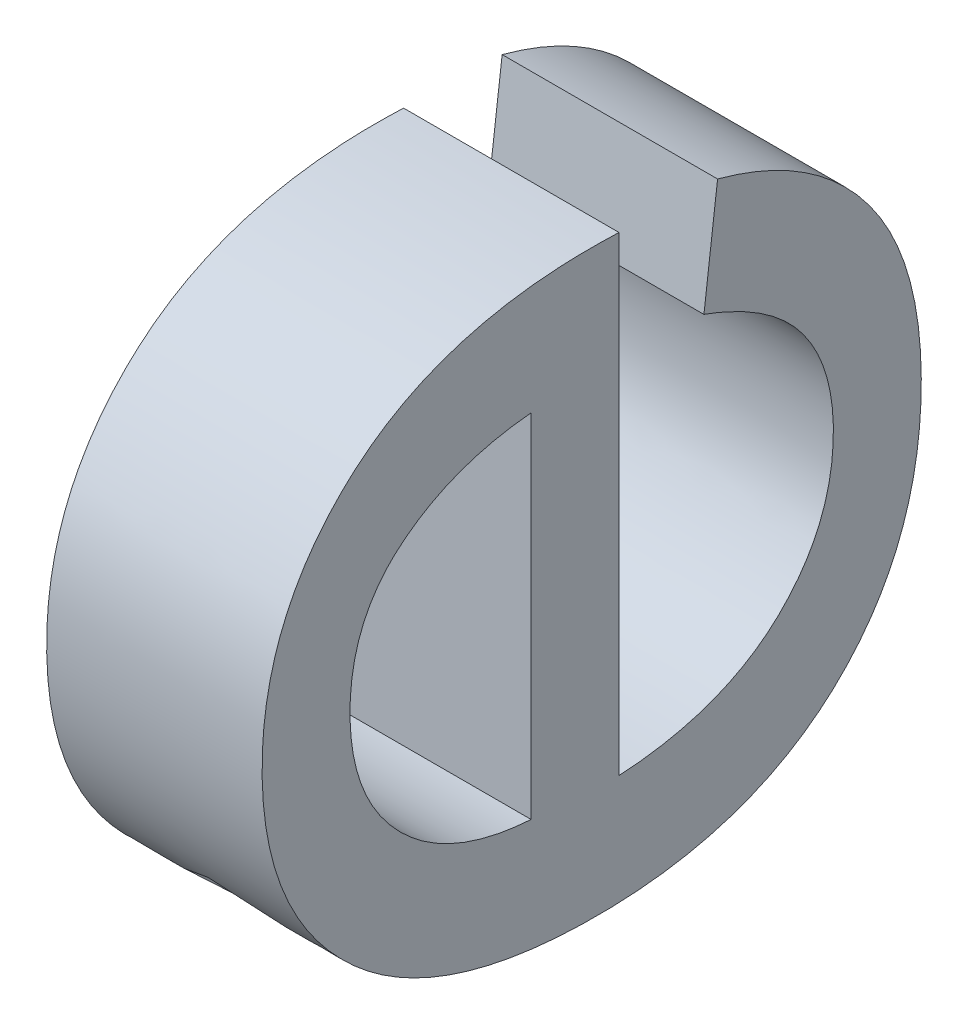
ISO-10303-21;
HEADER;
FILE_DESCRIPTION(('STEP AP214'),'2;1');
FILE_NAME('part.step','',(''),(''),'','','');
FILE_SCHEMA(('AUTOMOTIVE_DESIGN { 1 0 10303 214 1 1 1 1 }'));
ENDSEC;
DATA;
#1=APPLICATION_CONTEXT('core data for automotive mechanical design processes');
#2=APPLICATION_PROTOCOL_DEFINITION('international standard','automotive_design',2000,#1);
#3=PRODUCT_CONTEXT('',#1,'mechanical');
#4=PRODUCT('Part','Part','',(#3));
#5=PRODUCT_RELATED_PRODUCT_CATEGORY('part','',(#4));
#6=PRODUCT_DEFINITION_FORMATION('','',#4);
#7=PRODUCT_DEFINITION_CONTEXT('part definition',#1,'design');
#8=PRODUCT_DEFINITION('design','',#6,#7);
#9=PRODUCT_DEFINITION_SHAPE('','',#8);
#10=(LENGTH_UNIT() NAMED_UNIT(*) SI_UNIT(.MILLI.,.METRE.));
#11=(NAMED_UNIT(*) PLANE_ANGLE_UNIT() SI_UNIT($,.RADIAN.));
#12=(NAMED_UNIT(*) SI_UNIT($,.STERADIAN.) SOLID_ANGLE_UNIT());
#13=UNCERTAINTY_MEASURE_WITH_UNIT(LENGTH_MEASURE(1.E-05),#10,'distance_accuracy_value','');
#14=(GEOMETRIC_REPRESENTATION_CONTEXT(3) GLOBAL_UNCERTAINTY_ASSIGNED_CONTEXT((#13)) GLOBAL_UNIT_ASSIGNED_CONTEXT((#10,
#11,#12)) REPRESENTATION_CONTEXT('',''));
#15=CARTESIAN_POINT('',(0.,0.,0.));
#16=DIRECTION('',(0.,0.,1.));
#17=DIRECTION('',(1.,0.,0.));
#18=AXIS2_PLACEMENT_3D('',#15,#16,#17);
#19=CARTESIAN_POINT('',(4.55229940712892,-37.8479146998707,-8.87455840971013));
#20=DIRECTION('',(-1.,0.,0.));
#21=DIRECTION('',(0.,0.,1.));
#22=AXIS2_PLACEMENT_3D('',#19,#20,#21);
#23=PLANE('',#22);
#24=CARTESIAN_POINT('',(4.55229940712891,-37.7601534986081,-9.03767640216285));
#25=CARTESIAN_POINT('',(4.5522994071289,-37.6784222189086,-9.03767640216285));
#26=CARTESIAN_POINT('',(4.55229940712889,-37.596690939209,-9.03767640216285));
#27=(BOUNDED_CURVE() B_SPLINE_CURVE(2,(#24,#25,#26),.UNSPECIFIED.,.F.,
.F.) B_SPLINE_CURVE_WITH_KNOTS((3,3),(35.,36.),
.UNSPECIFIED.) CURVE() GEOMETRIC_REPRESENTATION_ITEM() RATIONAL_B_SPLINE_CURVE((1.,1.,1.)) REPRESENTATION_ITEM(''));
#28=CARTESIAN_POINT('',(4.55229940712891,-37.7601534986081,-9.03767640216285));
#29=VERTEX_POINT('',#28);
#30=CARTESIAN_POINT('',(4.55229940712889,-37.596690939209,-9.03767640216285));
#31=VERTEX_POINT('',#30);
#32=EDGE_CURVE('E134',#29,#31,#27,.T.);
#33=ORIENTED_EDGE('',*,*,#32,.T.);
#34=CARTESIAN_POINT('',(4.55229940712889,-37.596690939209,-9.03767640216285));
#35=CARTESIAN_POINT('',(4.55229940712889,-37.599998781895,-9.00073882550267));
#36=CARTESIAN_POINT('',(4.55229940712889,-37.6391415870125,-8.95360206722736));
#37=CARTESIAN_POINT('',(4.5522994071289,-37.7110871654327,-8.95360206722736));
#38=CARTESIAN_POINT('',(4.55229940712891,-37.7576726165936,-8.99936055771684));
#39=CARTESIAN_POINT('',(4.55229940712891,-37.7601534986081,-9.03767640216285));
#40=(BOUNDED_CURVE() B_SPLINE_CURVE(2,(#34,#35,#36,#37,#38,#39),.UNSPECIFIED.,.F.,
.F.) B_SPLINE_CURVE_WITH_KNOTS((3,1,1,1,3),(36.,37.,38.,39.,40.),
.UNSPECIFIED.) CURVE() GEOMETRIC_REPRESENTATION_ITEM() RATIONAL_B_SPLINE_CURVE((1.,1.,1.,1.,1.,1.)) REPRESENTATION_ITEM(''));
#41=EDGE_CURVE('E11',#31,#29,#40,.T.);
#42=ORIENTED_EDGE('',*,*,#41,.T.);
#43=EDGE_LOOP('',(#33,#42));
#44=FACE_BOUND('',#43,.T.);
#45=CARTESIAN_POINT('',(4.55229940712888,-37.5459706846905,-9.12423161911283));
#46=CARTESIAN_POINT('',(4.55229940712888,-37.5580994412058,-9.16916314893081));
#47=CARTESIAN_POINT('',(4.55229940712889,-37.5909022145085,-9.19397196907571));
#48=CARTESIAN_POINT('',(4.55229940712889,-37.6237049878112,-9.21878078922061));
#49=CARTESIAN_POINT('',(4.5522994071289,-37.6747008958868,-9.21878078922061));
#50=CARTESIAN_POINT('',(4.55229940712891,-37.7389281747064,-9.21878078922061));
#51=CARTESIAN_POINT('',(4.55229940712891,-37.7765548852595,-9.17922450376736));
#52=CARTESIAN_POINT('',(4.55229940712892,-37.8141815958126,-9.1396682183141));
#53=CARTESIAN_POINT('',(4.55229940712892,-37.8141815958126,-9.06827394700823));
#54=CARTESIAN_POINT('',(4.55229940712892,-37.8141815958126,-8.99439879368786));
#55=CARTESIAN_POINT('',(4.55229940712891,-37.7761414049237,-8.95360206722736));
#56=CARTESIAN_POINT('',(4.5522994071289,-37.7381012140349,-8.91280534076686));
#57=CARTESIAN_POINT('',(4.5522994071289,-37.6774574314585,-8.91280534076686));
#58=CARTESIAN_POINT('',(4.55229940712889,-37.6187432237822,-8.91280534076686));
#59=CARTESIAN_POINT('',(4.55229940712888,-37.5815299935648,-8.95277510655587));
#60=CARTESIAN_POINT('',(4.55229940712888,-37.5443167633475,-8.99274487234486));
#61=CARTESIAN_POINT('',(4.55229940712888,-37.5443167633475,-9.0652417578794));
#62=CARTESIAN_POINT('',(4.55229940712888,-37.5443167633475,-9.06965221479405));
#63=CARTESIAN_POINT('',(4.55229940712888,-37.5445924169047,-9.07847312862335));
#64=(BOUNDED_CURVE() B_SPLINE_CURVE(2,(#45,#46,#47,#48,#49,#50,#51,#52,#53,#54,#55,#56,#57,#58,
#59,#60,#61,#62,#63),.UNSPECIFIED.,.F.,.F.) B_SPLINE_CURVE_WITH_KNOTS((3,2,2,2,2,2,2,2,2,3),
(20.,21.,22.,23.,24.,25.,26.,27.,28.,29.),
.UNSPECIFIED.) CURVE() GEOMETRIC_REPRESENTATION_ITEM() RATIONAL_B_SPLINE_CURVE((1.,1.,1.,1.,1.,
1.,1.,1.,1.,1.,1.,1.,1.,1.,1.,1.,1.,1.,1.)) REPRESENTATION_ITEM(''));
#65=CARTESIAN_POINT('',(4.55229940712888,-37.5459706846905,-9.12423161911283));
#66=VERTEX_POINT('',#65);
#67=CARTESIAN_POINT('',(4.55229940712888,-37.5445924169047,-9.07847312862335));
#68=VERTEX_POINT('',#67);
#69=EDGE_CURVE('E150',#66,#68,#64,.T.);
#70=ORIENTED_EDGE('',*,*,#69,.T.);
#71=CARTESIAN_POINT('',(4.55229940712888,-37.5445924169047,-9.07847312862335));
#72=CARTESIAN_POINT('',(4.55229940712889,-37.6537512255422,-9.07847312862335));
#73=CARTESIAN_POINT('',(4.55229940712891,-37.7629100341798,-9.07847312862335));
#74=(BOUNDED_CURVE() B_SPLINE_CURVE(2,(#71,#72,#73),.UNSPECIFIED.,.F.,
.F.) B_SPLINE_CURVE_WITH_KNOTS((3,3),(29.,30.),
.UNSPECIFIED.) CURVE() GEOMETRIC_REPRESENTATION_ITEM() RATIONAL_B_SPLINE_CURVE((1.,1.,1.)) REPRESENTATION_ITEM(''));
#75=CARTESIAN_POINT('',(4.55229940712891,-37.7629100341798,-9.07847312862335));
#76=VERTEX_POINT('',#75);
#77=EDGE_CURVE('E111',#68,#76,#74,.T.);
#78=ORIENTED_EDGE('',*,*,#77,.T.);
#79=CARTESIAN_POINT('',(4.55229940712891,-37.7629100341798,-9.07847312862335));
#80=CARTESIAN_POINT('',(4.55229940712891,-37.7601534986081,-9.12671250112732));
#81=CARTESIAN_POINT('',(4.55229940712891,-37.7356203320204,-9.15234828194372));
#82=CARTESIAN_POINT('',(4.5522994071289,-37.7110871654327,-9.17798406276011));
#83=CARTESIAN_POINT('',(4.5522994071289,-37.6744252423296,-9.17798406276011));
#84=CARTESIAN_POINT('',(4.55229940712889,-37.6471355401703,-9.17798406276011));
#85=CARTESIAN_POINT('',(4.55229940712889,-37.6278397911687,-9.1636500777875));
#86=CARTESIAN_POINT('',(4.55229940712889,-37.6085440421671,-9.14931609281489));
#87=CARTESIAN_POINT('',(4.55229940712889,-37.5972422463233,-9.11789158729802));
#88=(BOUNDED_CURVE() B_SPLINE_CURVE(2,(#79,#80,#81,#82,#83,#84,#85,#86,#87),.UNSPECIFIED.,.F.,
.F.) B_SPLINE_CURVE_WITH_KNOTS((3,2,2,2,3),(30.,31.,32.,33.,34.),
.UNSPECIFIED.) CURVE() GEOMETRIC_REPRESENTATION_ITEM() RATIONAL_B_SPLINE_CURVE((1.,1.,1.,1.,1.,
1.,1.,1.,1.)) REPRESENTATION_ITEM(''));
#89=CARTESIAN_POINT('',(4.55229940712889,-37.5972422463233,-9.11789158729802));
#90=VERTEX_POINT('',#89);
#91=EDGE_CURVE('E97',#76,#90,#88,.T.);
#92=ORIENTED_EDGE('',*,*,#91,.T.);
#93=CARTESIAN_POINT('',(4.55229940712889,-37.5972422463233,-9.11789158729802));
#94=CARTESIAN_POINT('',(4.55229940712888,-37.5716064655069,-9.12106160320542));
#95=CARTESIAN_POINT('',(4.55229940712888,-37.5459706846905,-9.12423161911283));
#96=(BOUNDED_CURVE() B_SPLINE_CURVE(2,(#93,#94,#95),.UNSPECIFIED.,.F.,
.F.) B_SPLINE_CURVE_WITH_KNOTS((3,3),(34.,35.),
.UNSPECIFIED.) CURVE() GEOMETRIC_REPRESENTATION_ITEM() RATIONAL_B_SPLINE_CURVE((1.,1.,1.)) REPRESENTATION_ITEM(''));
#97=EDGE_CURVE('E96',#90,#66,#96,.T.);
#98=ORIENTED_EDGE('',*,*,#97,.T.);
#99=EDGE_LOOP('',(#70,#78,#92,#98));
#100=FACE_BOUND('',#99,.T.);
#101=ADVANCED_FACE('F16',(#44,#100),#23,.T.);
#102=CARTESIAN_POINT('',(4.65229940712892,-37.8479146998707,-8.87455840971013));
#103=DIRECTION('',(1.,0.,0.));
#104=DIRECTION('',(0.,1.,0.));
#105=AXIS2_PLACEMENT_3D('',#102,#103,#104);
#106=PLANE('',#105);
#107=CARTESIAN_POINT('',(4.65229940712889,-37.596690939209,-9.03767640216285));
#108=CARTESIAN_POINT('',(4.65229940712889,-37.5999987818949,-9.00073882550267));
#109=CARTESIAN_POINT('',(4.65229940712889,-37.6391415870125,-8.95360206722737));
#110=CARTESIAN_POINT('',(4.6522994071289,-37.7110871654326,-8.95360206722737));
#111=CARTESIAN_POINT('',(4.65229940712891,-37.7576726165936,-8.99936055771684));
#112=CARTESIAN_POINT('',(4.65229940712891,-37.7601534986081,-9.03767640216285));
#113=(BOUNDED_CURVE() B_SPLINE_CURVE(2,(#107,#108,#109,#110,#111,#112),.UNSPECIFIED.,.F.,
.F.) B_SPLINE_CURVE_WITH_KNOTS((3,1,1,1,3),(36.,37.,38.,39.,40.),
.UNSPECIFIED.) CURVE() GEOMETRIC_REPRESENTATION_ITEM() RATIONAL_B_SPLINE_CURVE((1.,1.,1.,1.,1.,1.)) REPRESENTATION_ITEM(''));
#114=CARTESIAN_POINT('',(4.65229940712889,-37.596690939209,-9.03767640216285));
#115=VERTEX_POINT('',#114);
#116=CARTESIAN_POINT('',(4.65229940712891,-37.7601534986081,-9.03767640216285));
#117=VERTEX_POINT('',#116);
#118=EDGE_CURVE('E31',#115,#117,#113,.T.);
#119=ORIENTED_EDGE('',*,*,#118,.F.);
#120=CARTESIAN_POINT('',(4.65229940712891,-37.7601534986081,-9.03767640216285));
#121=CARTESIAN_POINT('',(4.6522994071289,-37.6784222189086,-9.03767640216285));
#122=CARTESIAN_POINT('',(4.65229940712889,-37.596690939209,-9.03767640216285));
#123=(BOUNDED_CURVE() B_SPLINE_CURVE(2,(#120,#121,#122),.UNSPECIFIED.,.F.,
.F.) B_SPLINE_CURVE_WITH_KNOTS((3,3),(35.,36.),
.UNSPECIFIED.) CURVE() GEOMETRIC_REPRESENTATION_ITEM() RATIONAL_B_SPLINE_CURVE((1.,1.,1.)) REPRESENTATION_ITEM(''));
#124=EDGE_CURVE('E123',#117,#115,#123,.T.);
#125=ORIENTED_EDGE('',*,*,#124,.F.);
#126=EDGE_LOOP('',(#119,#125));
#127=FACE_BOUND('',#126,.T.);
#128=CARTESIAN_POINT('',(4.65229940712889,-37.5972422463233,-9.11789158729802));
#129=CARTESIAN_POINT('',(4.65229940712888,-37.5716064655069,-9.12106160320542));
#130=CARTESIAN_POINT('',(4.65229940712888,-37.5459706846905,-9.12423161911283));
#131=(BOUNDED_CURVE() B_SPLINE_CURVE(2,(#128,#129,#130),.UNSPECIFIED.,.F.,
.F.) B_SPLINE_CURVE_WITH_KNOTS((3,3),(34.,35.),
.UNSPECIFIED.) CURVE() GEOMETRIC_REPRESENTATION_ITEM() RATIONAL_B_SPLINE_CURVE((1.,1.,1.)) REPRESENTATION_ITEM(''));
#132=CARTESIAN_POINT('',(4.65229940712889,-37.5972422463233,-9.11789158729802));
#133=VERTEX_POINT('',#132);
#134=CARTESIAN_POINT('',(4.65229940712888,-37.5459706846905,-9.12423161911283));
#135=VERTEX_POINT('',#134);
#136=EDGE_CURVE('E85',#133,#135,#131,.T.);
#137=ORIENTED_EDGE('',*,*,#136,.F.);
#138=CARTESIAN_POINT('',(4.65229940712891,-37.7629100341798,-9.07847312862335));
#139=CARTESIAN_POINT('',(4.65229940712891,-37.7601534986081,-9.12671250112732));
#140=CARTESIAN_POINT('',(4.65229940712891,-37.7356203320204,-9.15234828194372));
#141=CARTESIAN_POINT('',(4.6522994071289,-37.7110871654326,-9.17798406276011));
#142=CARTESIAN_POINT('',(4.6522994071289,-37.6744252423296,-9.17798406276011));
#143=CARTESIAN_POINT('',(4.6522994071289,-37.6471355401703,-9.17798406276011));
#144=CARTESIAN_POINT('',(4.65229940712889,-37.6278397911687,-9.1636500777875));
#145=CARTESIAN_POINT('',(4.65229940712889,-37.6085440421671,-9.14931609281489));
#146=CARTESIAN_POINT('',(4.65229940712889,-37.5972422463233,-9.11789158729802));
#147=(BOUNDED_CURVE() B_SPLINE_CURVE(2,(#138,#139,#140,#141,#142,#143,#144,#145,#146),
.UNSPECIFIED.,.F.,.F.) B_SPLINE_CURVE_WITH_KNOTS((3,2,2,2,3),(30.,31.,32.,33.,34.),
.UNSPECIFIED.) CURVE() GEOMETRIC_REPRESENTATION_ITEM() RATIONAL_B_SPLINE_CURVE((1.,1.,1.,1.,1.,
1.,1.,1.,1.)) REPRESENTATION_ITEM(''));
#148=CARTESIAN_POINT('',(4.65229940712891,-37.7629100341798,-9.07847312862335));
#149=VERTEX_POINT('',#148);
#150=EDGE_CURVE('E89',#149,#133,#147,.T.);
#151=ORIENTED_EDGE('',*,*,#150,.F.);
#152=CARTESIAN_POINT('',(4.65229940712888,-37.5445924169047,-9.07847312862335));
#153=CARTESIAN_POINT('',(4.6522994071289,-37.6537512255422,-9.07847312862335));
#154=CARTESIAN_POINT('',(4.65229940712891,-37.7629100341798,-9.07847312862335));
#155=(BOUNDED_CURVE() B_SPLINE_CURVE(2,(#152,#153,#154),.UNSPECIFIED.,.F.,
.F.) B_SPLINE_CURVE_WITH_KNOTS((3,3),(29.,30.),
.UNSPECIFIED.) CURVE() GEOMETRIC_REPRESENTATION_ITEM() RATIONAL_B_SPLINE_CURVE((1.,1.,1.)) REPRESENTATION_ITEM(''));
#156=CARTESIAN_POINT('',(4.65229940712888,-37.5445924169047,-9.07847312862335));
#157=VERTEX_POINT('',#156);
#158=EDGE_CURVE('E192',#157,#149,#155,.T.);
#159=ORIENTED_EDGE('',*,*,#158,.F.);
#160=CARTESIAN_POINT('',(4.65229940712888,-37.5459706846905,-9.12423161911283));
#161=CARTESIAN_POINT('',(4.65229940712888,-37.5580994412058,-9.16916314893081));
#162=CARTESIAN_POINT('',(4.65229940712889,-37.5909022145085,-9.19397196907571));
#163=CARTESIAN_POINT('',(4.65229940712889,-37.6237049878112,-9.21878078922061));
#164=CARTESIAN_POINT('',(4.6522994071289,-37.6747008958868,-9.21878078922061));
#165=CARTESIAN_POINT('',(4.65229940712891,-37.7389281747064,-9.21878078922061));
#166=CARTESIAN_POINT('',(4.65229940712891,-37.7765548852595,-9.17922450376736));
#167=CARTESIAN_POINT('',(4.65229940712892,-37.8141815958126,-9.1396682183141));
#168=CARTESIAN_POINT('',(4.65229940712892,-37.8141815958126,-9.06827394700823));
#169=CARTESIAN_POINT('',(4.65229940712892,-37.8141815958126,-8.99439879368786));
#170=CARTESIAN_POINT('',(4.65229940712891,-37.7761414049237,-8.95360206722737));
#171=CARTESIAN_POINT('',(4.65229940712891,-37.7381012140349,-8.91280534076686));
#172=CARTESIAN_POINT('',(4.6522994071289,-37.6774574314584,-8.91280534076686));
#173=CARTESIAN_POINT('',(4.65229940712889,-37.6187432237822,-8.91280534076686));
#174=CARTESIAN_POINT('',(4.65229940712888,-37.5815299935648,-8.95277510655587));
#175=CARTESIAN_POINT('',(4.65229940712888,-37.5443167633475,-8.99274487234487));
#176=CARTESIAN_POINT('',(4.65229940712888,-37.5443167633475,-9.0652417578794));
#177=CARTESIAN_POINT('',(4.65229940712888,-37.5443167633475,-9.06965221479405));
#178=CARTESIAN_POINT('',(4.65229940712888,-37.5445924169047,-9.07847312862335));
#179=(BOUNDED_CURVE() B_SPLINE_CURVE(2,(#160,#161,#162,#163,#164,#165,#166,#167,#168,#169,#170,
#171,#172,#173,#174,#175,#176,#177,#178),.UNSPECIFIED.,.F.,.F.) B_SPLINE_CURVE_WITH_KNOTS((3,2,
2,2,2,2,2,2,2,3),(20.,21.,22.,23.,24.,25.,26.,27.,28.,29.),
.UNSPECIFIED.) CURVE() GEOMETRIC_REPRESENTATION_ITEM() RATIONAL_B_SPLINE_CURVE((1.,1.,1.,1.,1.,
1.,1.,1.,1.,1.,1.,1.,1.,1.,1.,1.,1.,1.,1.)) REPRESENTATION_ITEM(''));
#180=EDGE_CURVE('E22',#135,#157,#179,.T.);
#181=ORIENTED_EDGE('',*,*,#180,.F.);
#182=EDGE_LOOP('',(#137,#151,#159,#181));
#183=FACE_BOUND('',#182,.T.);
#184=ADVANCED_FACE('F87',(#127,#183),#106,.T.);
#185=CARTESIAN_POINT('',(4.65229940712889,-37.596690939209,-9.03767640216285));
#186=CARTESIAN_POINT('',(4.55229940712889,-37.596690939209,-9.03767640216285));
#187=CARTESIAN_POINT('',(4.65229940712889,-37.5999987818949,-9.00073882550267));
#188=CARTESIAN_POINT('',(4.55229940712889,-37.599998781895,-9.00073882550267));
#189=CARTESIAN_POINT('',(4.65229940712889,-37.6391415870125,-8.95360206722737));
#190=CARTESIAN_POINT('',(4.55229940712889,-37.6391415870125,-8.95360206722736));
#191=CARTESIAN_POINT('',(4.6522994071289,-37.7110871654326,-8.95360206722737));
#192=CARTESIAN_POINT('',(4.5522994071289,-37.7110871654327,-8.95360206722736));
#193=CARTESIAN_POINT('',(4.65229940712891,-37.7576726165936,-8.99936055771684));
#194=CARTESIAN_POINT('',(4.55229940712891,-37.7576726165936,-8.99936055771684));
#195=CARTESIAN_POINT('',(4.65229940712891,-37.7601534986081,-9.03767640216285));
#196=CARTESIAN_POINT('',(4.55229940712891,-37.7601534986081,-9.03767640216285));
#197=(BOUNDED_SURFACE() B_SPLINE_SURFACE(2,1,((#185,#186),(#187,#188),(#189,#190),(#191,#192),
(#193,#194),(#195,#196)),.UNSPECIFIED.,.F.,.F.,.F.) B_SPLINE_SURFACE_WITH_KNOTS((3,1,1,1,3),(2,
2),(36.,37.,38.,39.,40.),(0.,0.1),
.UNSPECIFIED.) GEOMETRIC_REPRESENTATION_ITEM() RATIONAL_B_SPLINE_SURFACE(((1.,1.),(1.,1.),(1.,
1.),(1.,1.),(1.,1.),(1.,1.))) REPRESENTATION_ITEM('') SURFACE());
#198=CARTESIAN_POINT('',(4.65229940712891,-37.7601534986081,-9.03767640216285));
#199=CARTESIAN_POINT('',(4.55229940712891,-37.7601534986081,-9.03767640216285));
#200=(BOUNDED_CURVE() B_SPLINE_CURVE(1,(#198,#199),.UNSPECIFIED.,.F.,
.F.) B_SPLINE_CURVE_WITH_KNOTS((2,2),(0.,0.1),
.UNSPECIFIED.) CURVE() GEOMETRIC_REPRESENTATION_ITEM() RATIONAL_B_SPLINE_CURVE((1.,1.)) REPRESENTATION_ITEM(''));
#201=EDGE_CURVE('E135',#117,#29,#200,.T.);
#202=CARTESIAN_POINT('',(4.65229940712889,-37.596690939209,-9.03767640216285));
#203=CARTESIAN_POINT('',(4.55229940712889,-37.596690939209,-9.03767640216285));
#204=(BOUNDED_CURVE() B_SPLINE_CURVE(1,(#202,#203),.UNSPECIFIED.,.F.,
.F.) B_SPLINE_CURVE_WITH_KNOTS((2,2),(0.,0.1),
.UNSPECIFIED.) CURVE() GEOMETRIC_REPRESENTATION_ITEM() RATIONAL_B_SPLINE_CURVE((1.,1.)) REPRESENTATION_ITEM(''));
#205=EDGE_CURVE('E126',#115,#31,#204,.T.);
#206=ORIENTED_EDGE('',*,*,#118,.T.);
#207=ORIENTED_EDGE('',*,*,#201,.T.);
#208=ORIENTED_EDGE('',*,*,#41,.F.);
#209=ORIENTED_EDGE('',*,*,#205,.F.);
#210=EDGE_LOOP('',(#206,#207,#208,#209));
#211=FACE_BOUND('',#210,.T.);
#212=ADVANCED_FACE('F246',(#211),#197,.T.);
#213=CARTESIAN_POINT('',(4.65229940712891,-37.7601534986081,-9.03767640216285));
#214=CARTESIAN_POINT('',(4.55229940712891,-37.7601534986081,-9.03767640216285));
#215=CARTESIAN_POINT('',(4.6522994071289,-37.6784222189086,-9.03767640216285));
#216=CARTESIAN_POINT('',(4.5522994071289,-37.6784222189086,-9.03767640216285));
#217=CARTESIAN_POINT('',(4.65229940712889,-37.596690939209,-9.03767640216285));
#218=CARTESIAN_POINT('',(4.55229940712889,-37.596690939209,-9.03767640216285));
#219=(BOUNDED_SURFACE() B_SPLINE_SURFACE(2,1,((#213,#214),(#215,#216),(#217,#218)),
.UNSPECIFIED.,.F.,.F.,.F.) B_SPLINE_SURFACE_WITH_KNOTS((3,3),(2,2),(35.,36.),(0.,0.1),
.UNSPECIFIED.) GEOMETRIC_REPRESENTATION_ITEM() RATIONAL_B_SPLINE_SURFACE(((1.,1.),(1.,1.),(1.,1.))) REPRESENTATION_ITEM('') SURFACE());
#220=ORIENTED_EDGE('',*,*,#124,.T.);
#221=ORIENTED_EDGE('',*,*,#205,.T.);
#222=ORIENTED_EDGE('',*,*,#32,.F.);
#223=ORIENTED_EDGE('',*,*,#201,.F.);
#224=EDGE_LOOP('',(#220,#221,#222,#223));
#225=FACE_BOUND('',#224,.T.);
#226=ADVANCED_FACE('F241',(#225),#219,.T.);
#227=CARTESIAN_POINT('',(4.65229940712889,-37.5972422463233,-9.11789158729802));
#228=CARTESIAN_POINT('',(4.55229940712889,-37.5972422463233,-9.11789158729802));
#229=CARTESIAN_POINT('',(4.65229940712888,-37.5716064655069,-9.12106160320542));
#230=CARTESIAN_POINT('',(4.55229940712888,-37.5716064655069,-9.12106160320542));
#231=CARTESIAN_POINT('',(4.65229940712888,-37.5459706846905,-9.12423161911283));
#232=CARTESIAN_POINT('',(4.55229940712888,-37.5459706846905,-9.12423161911283));
#233=(BOUNDED_SURFACE() B_SPLINE_SURFACE(2,1,((#227,#228),(#229,#230),(#231,#232)),
.UNSPECIFIED.,.F.,.F.,.F.) B_SPLINE_SURFACE_WITH_KNOTS((3,3),(2,2),(34.,35.),(0.,0.1),
.UNSPECIFIED.) GEOMETRIC_REPRESENTATION_ITEM() RATIONAL_B_SPLINE_SURFACE(((1.,1.),(1.,1.),(1.,1.))) REPRESENTATION_ITEM('') SURFACE());
#234=CARTESIAN_POINT('',(4.65229940712888,-37.5459706846905,-9.12423161911283));
#235=CARTESIAN_POINT('',(4.55229940712888,-37.5459706846905,-9.12423161911283));
#236=(BOUNDED_CURVE() B_SPLINE_CURVE(1,(#234,#235),.UNSPECIFIED.,.F.,
.F.) B_SPLINE_CURVE_WITH_KNOTS((2,2),(0.,0.1),
.UNSPECIFIED.) CURVE() GEOMETRIC_REPRESENTATION_ITEM() RATIONAL_B_SPLINE_CURVE((1.,1.)) REPRESENTATION_ITEM(''));
#237=EDGE_CURVE('E158',#135,#66,#236,.T.);
#238=CARTESIAN_POINT('',(4.65229940712889,-37.5972422463233,-9.11789158729802));
#239=CARTESIAN_POINT('',(4.55229940712889,-37.5972422463233,-9.11789158729802));
#240=(BOUNDED_CURVE() B_SPLINE_CURVE(1,(#238,#239),.UNSPECIFIED.,.F.,
.F.) B_SPLINE_CURVE_WITH_KNOTS((2,2),(0.,0.1),
.UNSPECIFIED.) CURVE() GEOMETRIC_REPRESENTATION_ITEM() RATIONAL_B_SPLINE_CURVE((1.,1.)) REPRESENTATION_ITEM(''));
#241=EDGE_CURVE('E100',#133,#90,#240,.T.);
#242=ORIENTED_EDGE('',*,*,#136,.T.);
#243=ORIENTED_EDGE('',*,*,#237,.T.);
#244=ORIENTED_EDGE('',*,*,#97,.F.);
#245=ORIENTED_EDGE('',*,*,#241,.F.);
#246=EDGE_LOOP('',(#242,#243,#244,#245));
#247=FACE_BOUND('',#246,.T.);
#248=ADVANCED_FACE('F101',(#247),#233,.T.);
#249=CARTESIAN_POINT('',(4.65229940712891,-37.7629100341798,-9.07847312862335));
#250=CARTESIAN_POINT('',(4.55229940712891,-37.7629100341798,-9.07847312862335));
#251=CARTESIAN_POINT('',(4.65229940712891,-37.7601534986081,-9.12671250112732));
#252=CARTESIAN_POINT('',(4.55229940712891,-37.7601534986081,-9.12671250112732));
#253=CARTESIAN_POINT('',(4.65229940712891,-37.7356203320204,-9.15234828194372));
#254=CARTESIAN_POINT('',(4.55229940712891,-37.7356203320204,-9.15234828194372));
#255=CARTESIAN_POINT('',(4.6522994071289,-37.7110871654326,-9.17798406276011));
#256=CARTESIAN_POINT('',(4.5522994071289,-37.7110871654327,-9.17798406276011));
#257=CARTESIAN_POINT('',(4.6522994071289,-37.6744252423296,-9.17798406276011));
#258=CARTESIAN_POINT('',(4.5522994071289,-37.6744252423296,-9.17798406276011));
#259=CARTESIAN_POINT('',(4.6522994071289,-37.6471355401703,-9.17798406276011));
#260=CARTESIAN_POINT('',(4.55229940712889,-37.6471355401703,-9.17798406276011));
#261=CARTESIAN_POINT('',(4.65229940712889,-37.6278397911687,-9.1636500777875));
#262=CARTESIAN_POINT('',(4.55229940712889,-37.6278397911687,-9.1636500777875));
#263=CARTESIAN_POINT('',(4.65229940712889,-37.6085440421671,-9.14931609281489));
#264=CARTESIAN_POINT('',(4.55229940712889,-37.6085440421671,-9.14931609281489));
#265=CARTESIAN_POINT('',(4.65229940712889,-37.5972422463233,-9.11789158729802));
#266=CARTESIAN_POINT('',(4.55229940712889,-37.5972422463233,-9.11789158729802));
#267=(BOUNDED_SURFACE() B_SPLINE_SURFACE(2,1,((#249,#250),(#251,#252),(#253,#254),(#255,#256),
(#257,#258),(#259,#260),(#261,#262),(#263,#264),(#265,#266)),.UNSPECIFIED.,.F.,.F.,
.F.) B_SPLINE_SURFACE_WITH_KNOTS((3,2,2,2,3),(2,2),(30.,31.,32.,33.,34.),(0.,0.1),
.UNSPECIFIED.) GEOMETRIC_REPRESENTATION_ITEM() RATIONAL_B_SPLINE_SURFACE(((1.,1.),(1.,1.),(1.,
1.),(1.,1.),(1.,1.),(1.,1.),(1.,1.),(1.,1.),(1.,1.))) REPRESENTATION_ITEM('') SURFACE());
#268=CARTESIAN_POINT('',(4.65229940712891,-37.7629100341798,-9.07847312862335));
#269=CARTESIAN_POINT('',(4.55229940712891,-37.7629100341798,-9.07847312862335));
#270=(BOUNDED_CURVE() B_SPLINE_CURVE(1,(#268,#269),.UNSPECIFIED.,.F.,
.F.) B_SPLINE_CURVE_WITH_KNOTS((2,2),(0.,0.1),
.UNSPECIFIED.) CURVE() GEOMETRIC_REPRESENTATION_ITEM() RATIONAL_B_SPLINE_CURVE((1.,1.)) REPRESENTATION_ITEM(''));
#271=EDGE_CURVE('E108',#149,#76,#270,.T.);
#272=ORIENTED_EDGE('',*,*,#150,.T.);
#273=ORIENTED_EDGE('',*,*,#241,.T.);
#274=ORIENTED_EDGE('',*,*,#91,.F.);
#275=ORIENTED_EDGE('',*,*,#271,.F.);
#276=EDGE_LOOP('',(#272,#273,#274,#275));
#277=FACE_BOUND('',#276,.T.);
#278=ADVANCED_FACE('F106',(#277),#267,.T.);
#279=CARTESIAN_POINT('',(4.65229940712888,-37.5445924169047,-9.07847312862335));
#280=CARTESIAN_POINT('',(4.55229940712888,-37.5445924169047,-9.07847312862335));
#281=CARTESIAN_POINT('',(4.6522994071289,-37.6537512255422,-9.07847312862335));
#282=CARTESIAN_POINT('',(4.55229940712889,-37.6537512255422,-9.07847312862335));
#283=CARTESIAN_POINT('',(4.65229940712891,-37.7629100341798,-9.07847312862335));
#284=CARTESIAN_POINT('',(4.55229940712891,-37.7629100341798,-9.07847312862335));
#285=(BOUNDED_SURFACE() B_SPLINE_SURFACE(2,1,((#279,#280),(#281,#282),(#283,#284)),
.UNSPECIFIED.,.F.,.F.,.F.) B_SPLINE_SURFACE_WITH_KNOTS((3,3),(2,2),(29.,30.),(0.,0.1),
.UNSPECIFIED.) GEOMETRIC_REPRESENTATION_ITEM() RATIONAL_B_SPLINE_SURFACE(((1.,1.),(1.,1.),(1.,1.))) REPRESENTATION_ITEM('') SURFACE());
#286=CARTESIAN_POINT('',(4.65229940712888,-37.5445924169047,-9.07847312862335));
#287=CARTESIAN_POINT('',(4.55229940712888,-37.5445924169047,-9.07847312862335));
#288=(BOUNDED_CURVE() B_SPLINE_CURVE(1,(#286,#287),.UNSPECIFIED.,.F.,
.F.) B_SPLINE_CURVE_WITH_KNOTS((2,2),(0.,0.1),
.UNSPECIFIED.) CURVE() GEOMETRIC_REPRESENTATION_ITEM() RATIONAL_B_SPLINE_CURVE((1.,1.)) REPRESENTATION_ITEM(''));
#289=EDGE_CURVE('E159',#157,#68,#288,.T.);
#290=ORIENTED_EDGE('',*,*,#158,.T.);
#291=ORIENTED_EDGE('',*,*,#271,.T.);
#292=ORIENTED_EDGE('',*,*,#77,.F.);
#293=ORIENTED_EDGE('',*,*,#289,.F.);
#294=EDGE_LOOP('',(#290,#291,#292,#293));
#295=FACE_BOUND('',#294,.T.);
#296=ADVANCED_FACE('F253',(#295),#285,.T.);
#297=CARTESIAN_POINT('',(4.65229940712888,-37.5459706846905,-9.12423161911283));
#298=CARTESIAN_POINT('',(4.55229940712888,-37.5459706846905,-9.12423161911283));
#299=CARTESIAN_POINT('',(4.65229940712888,-37.5580994412058,-9.16916314893081));
#300=CARTESIAN_POINT('',(4.55229940712888,-37.5580994412058,-9.16916314893081));
#301=CARTESIAN_POINT('',(4.65229940712889,-37.5909022145085,-9.19397196907571));
#302=CARTESIAN_POINT('',(4.55229940712889,-37.5909022145085,-9.19397196907571));
#303=CARTESIAN_POINT('',(4.65229940712889,-37.6237049878112,-9.21878078922061));
#304=CARTESIAN_POINT('',(4.55229940712889,-37.6237049878112,-9.21878078922061));
#305=CARTESIAN_POINT('',(4.6522994071289,-37.6747008958868,-9.21878078922061));
#306=CARTESIAN_POINT('',(4.5522994071289,-37.6747008958868,-9.21878078922061));
#307=CARTESIAN_POINT('',(4.65229940712891,-37.7389281747064,-9.21878078922061));
#308=CARTESIAN_POINT('',(4.55229940712891,-37.7389281747064,-9.21878078922061));
#309=CARTESIAN_POINT('',(4.65229940712891,-37.7765548852595,-9.17922450376736));
#310=CARTESIAN_POINT('',(4.55229940712891,-37.7765548852595,-9.17922450376736));
#311=CARTESIAN_POINT('',(4.65229940712892,-37.8141815958126,-9.1396682183141));
#312=CARTESIAN_POINT('',(4.55229940712892,-37.8141815958126,-9.1396682183141));
#313=CARTESIAN_POINT('',(4.65229940712892,-37.8141815958126,-9.06827394700823));
#314=CARTESIAN_POINT('',(4.55229940712892,-37.8141815958126,-9.06827394700823));
#315=CARTESIAN_POINT('',(4.65229940712892,-37.8141815958126,-8.99439879368786));
#316=CARTESIAN_POINT('',(4.55229940712892,-37.8141815958126,-8.99439879368786));
#317=CARTESIAN_POINT('',(4.65229940712891,-37.7761414049237,-8.95360206722737));
#318=CARTESIAN_POINT('',(4.55229940712891,-37.7761414049237,-8.95360206722736));
#319=CARTESIAN_POINT('',(4.65229940712891,-37.7381012140349,-8.91280534076686));
#320=CARTESIAN_POINT('',(4.5522994071289,-37.7381012140349,-8.91280534076686));
#321=CARTESIAN_POINT('',(4.6522994071289,-37.6774574314584,-8.91280534076686));
#322=CARTESIAN_POINT('',(4.5522994071289,-37.6774574314585,-8.91280534076686));
#323=CARTESIAN_POINT('',(4.65229940712889,-37.6187432237822,-8.91280534076686));
#324=CARTESIAN_POINT('',(4.55229940712889,-37.6187432237822,-8.91280534076686));
#325=CARTESIAN_POINT('',(4.65229940712888,-37.5815299935648,-8.95277510655587));
#326=CARTESIAN_POINT('',(4.55229940712888,-37.5815299935648,-8.95277510655587));
#327=CARTESIAN_POINT('',(4.65229940712888,-37.5443167633475,-8.99274487234487));
#328=CARTESIAN_POINT('',(4.55229940712888,-37.5443167633475,-8.99274487234486));
#329=CARTESIAN_POINT('',(4.65229940712888,-37.5443167633475,-9.0652417578794));
#330=CARTESIAN_POINT('',(4.55229940712888,-37.5443167633475,-9.0652417578794));
#331=CARTESIAN_POINT('',(4.65229940712888,-37.5443167633475,-9.06965221479405));
#332=CARTESIAN_POINT('',(4.55229940712888,-37.5443167633475,-9.06965221479405));
#333=CARTESIAN_POINT('',(4.65229940712888,-37.5445924169047,-9.07847312862335));
#334=CARTESIAN_POINT('',(4.55229940712888,-37.5445924169047,-9.07847312862335));
#335=(BOUNDED_SURFACE() B_SPLINE_SURFACE(2,1,((#297,#298),(#299,#300),(#301,#302),(#303,#304),
(#305,#306),(#307,#308),(#309,#310),(#311,#312),(#313,#314),(#315,#316),(#317,#318),(#319,#320),
(#321,#322),(#323,#324),(#325,#326),(#327,#328),(#329,#330),(#331,#332),(#333,#334)),
.UNSPECIFIED.,.F.,.F.,.F.) B_SPLINE_SURFACE_WITH_KNOTS((3,2,2,2,2,2,2,2,2,3),(2,2),(20.,21.,22.,
23.,24.,25.,26.,27.,28.,29.),(0.,0.1),
.UNSPECIFIED.) GEOMETRIC_REPRESENTATION_ITEM() RATIONAL_B_SPLINE_SURFACE(((1.,1.),(1.,1.),(1.,
1.),(1.,1.),(1.,1.),(1.,1.),(1.,1.),(1.,1.),(1.,1.),(1.,1.),(1.,1.),(1.,1.),(1.,1.),(1.,1.),(1.,
1.),(1.,1.),(1.,1.),(1.,1.),(1.,1.))) REPRESENTATION_ITEM('') SURFACE());
#336=ORIENTED_EDGE('',*,*,#180,.T.);
#337=ORIENTED_EDGE('',*,*,#289,.T.);
#338=ORIENTED_EDGE('',*,*,#69,.F.);
#339=ORIENTED_EDGE('',*,*,#237,.F.);
#340=EDGE_LOOP('',(#336,#337,#338,#339));
#341=FACE_BOUND('',#340,.T.);
#342=ADVANCED_FACE('F18',(#341),#335,.T.);
#343=CLOSED_SHELL('',(#101,#184,#212,#226,#248,#278,#296,#342));
#344=MANIFOLD_SOLID_BREP('B1',#343);
#345=ADVANCED_BREP_SHAPE_REPRESENTATION('',(#18,#344),#14);
#346=SHAPE_DEFINITION_REPRESENTATION(#9,#345);
ENDSEC;
END-ISO-10303-21;
